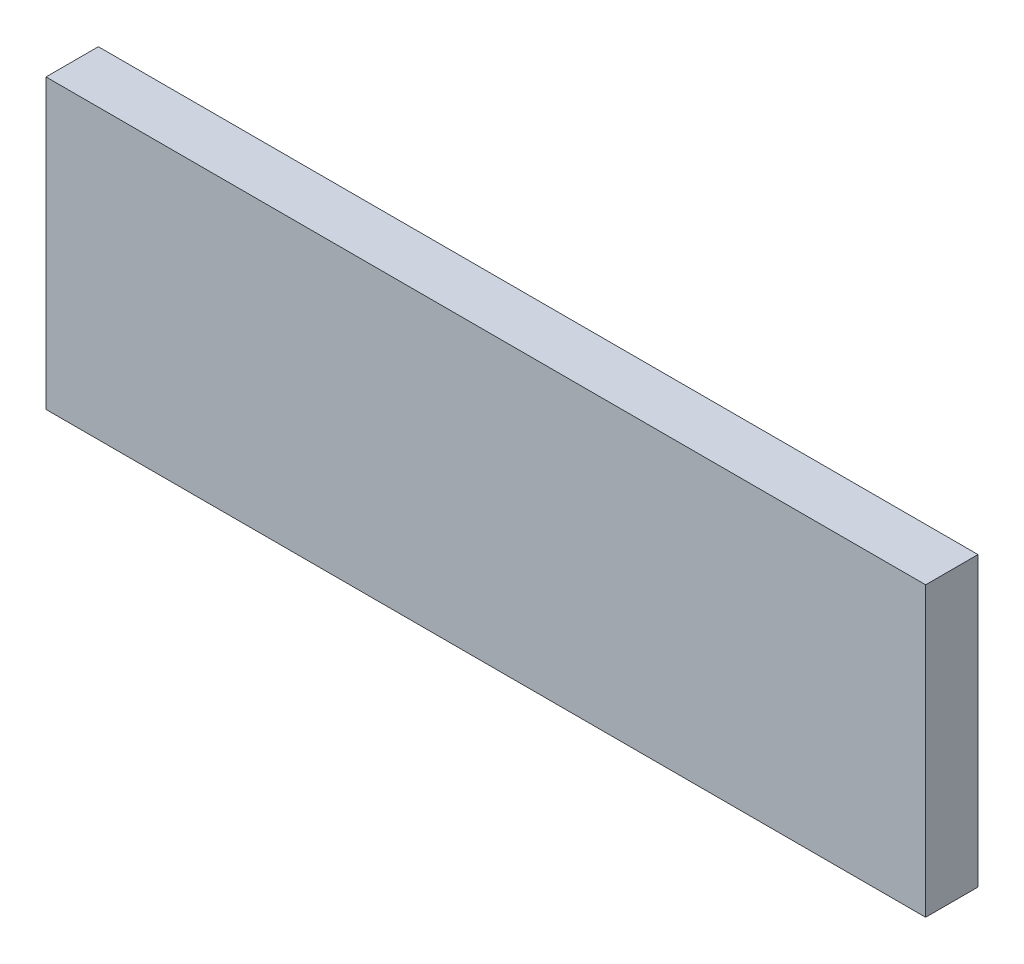
ISO-10303-21;
HEADER;
FILE_DESCRIPTION(('STEP AP214'),'2;1');
FILE_NAME('part.step','',(''),(''),'','','');
FILE_SCHEMA(('AUTOMOTIVE_DESIGN { 1 0 10303 214 1 1 1 1 }'));
ENDSEC;
DATA;
#1=APPLICATION_CONTEXT('core data for automotive mechanical design processes');
#2=APPLICATION_PROTOCOL_DEFINITION('international standard','automotive_design',2000,#1);
#3=PRODUCT_CONTEXT('',#1,'mechanical');
#4=PRODUCT('Part','Part','',(#3));
#5=PRODUCT_RELATED_PRODUCT_CATEGORY('part','',(#4));
#6=PRODUCT_DEFINITION_FORMATION('','',#4);
#7=PRODUCT_DEFINITION_CONTEXT('part definition',#1,'design');
#8=PRODUCT_DEFINITION('design','',#6,#7);
#9=PRODUCT_DEFINITION_SHAPE('','',#8);
#10=(LENGTH_UNIT() NAMED_UNIT(*) SI_UNIT(.MILLI.,.METRE.));
#11=(NAMED_UNIT(*) PLANE_ANGLE_UNIT() SI_UNIT($,.RADIAN.));
#12=(NAMED_UNIT(*) SI_UNIT($,.STERADIAN.) SOLID_ANGLE_UNIT());
#13=UNCERTAINTY_MEASURE_WITH_UNIT(LENGTH_MEASURE(1.E-05),#10,'distance_accuracy_value','');
#14=(GEOMETRIC_REPRESENTATION_CONTEXT(3) GLOBAL_UNCERTAINTY_ASSIGNED_CONTEXT((#13)) GLOBAL_UNIT_ASSIGNED_CONTEXT((#10,
#11,#12)) REPRESENTATION_CONTEXT('',''));
#15=CARTESIAN_POINT('',(0.,0.,0.));
#16=DIRECTION('',(0.,0.,1.));
#17=DIRECTION('',(1.,0.,0.));
#18=AXIS2_PLACEMENT_3D('',#15,#16,#17);
#19=CARTESIAN_POINT('',(-88.09649989415,196.736292428198,10.));
#20=DIRECTION('',(1.,0.,0.));
#21=DIRECTION('',(0.,1.,0.));
#22=AXIS2_PLACEMENT_3D('',#19,#20,#21);
#23=PLANE('',#22);
#24=DIRECTION('',(0.,-1.,0.));
#25=VECTOR('',#24,1.);
#26=CARTESIAN_POINT('',(-88.09649989415,196.736292428198,0.));
#27=LINE('',#26,#25);
#28=CARTESIAN_POINT('',(-88.09649989415,196.736292428198,0.));
#29=VERTEX_POINT('',#28);
#30=CARTESIAN_POINT('',(-88.09649989415,141.736292428198,0.));
#31=VERTEX_POINT('',#30);
#32=EDGE_CURVE('E109',#29,#31,#27,.T.);
#33=ORIENTED_EDGE('',*,*,#32,.T.);
#34=DIRECTION('',(0.,0.,-1.));
#35=VECTOR('',#34,1.);
#36=CARTESIAN_POINT('',(-88.09649989415,141.736292428198,10.));
#37=LINE('',#36,#35);
#38=CARTESIAN_POINT('',(-88.09649989415,141.736292428198,10.));
#39=VERTEX_POINT('',#38);
#40=EDGE_CURVE('E11',#39,#31,#37,.T.);
#41=ORIENTED_EDGE('',*,*,#40,.F.);
#42=DIRECTION('',(0.,-1.,0.));
#43=VECTOR('',#42,1.);
#44=CARTESIAN_POINT('',(-88.09649989415,196.736292428198,10.));
#45=LINE('',#44,#43);
#46=CARTESIAN_POINT('',(-88.09649989415,196.736292428198,10.));
#47=VERTEX_POINT('',#46);
#48=EDGE_CURVE('E92',#47,#39,#45,.T.);
#49=ORIENTED_EDGE('',*,*,#48,.F.);
#50=DIRECTION('',(0.,0.,-1.));
#51=VECTOR('',#50,1.);
#52=CARTESIAN_POINT('',(-88.09649989415,196.736292428198,10.));
#53=LINE('',#52,#51);
#54=EDGE_CURVE('E105',#47,#29,#53,.T.);
#55=ORIENTED_EDGE('',*,*,#54,.T.);
#56=EDGE_LOOP('',(#33,#41,#49,#55));
#57=FACE_BOUND('',#56,.T.);
#58=ADVANCED_FACE('F39',(#57),#23,.F.);
#59=CARTESIAN_POINT('',(-88.09649989415,141.736292428198,10.));
#60=DIRECTION('',(0.,1.,0.));
#61=DIRECTION('',(0.,0.,1.));
#62=AXIS2_PLACEMENT_3D('',#59,#60,#61);
#63=PLANE('',#62);
#64=DIRECTION('',(1.,0.,0.));
#65=VECTOR('',#64,1.);
#66=CARTESIAN_POINT('',(-88.09649989415,141.736292428198,0.));
#67=LINE('',#66,#65);
#68=CARTESIAN_POINT('',(79.90350010585,141.736292428198,0.));
#69=VERTEX_POINT('',#68);
#70=EDGE_CURVE('E97',#31,#69,#67,.T.);
#71=ORIENTED_EDGE('',*,*,#70,.T.);
#72=DIRECTION('',(0.,0.,-1.));
#73=VECTOR('',#72,1.);
#74=CARTESIAN_POINT('',(79.90350010585,141.736292428198,10.));
#75=LINE('',#74,#73);
#76=CARTESIAN_POINT('',(79.90350010585,141.736292428198,10.));
#77=VERTEX_POINT('',#76);
#78=EDGE_CURVE('E47',#77,#69,#75,.T.);
#79=ORIENTED_EDGE('',*,*,#78,.F.);
#80=DIRECTION('',(1.,0.,0.));
#81=VECTOR('',#80,1.);
#82=CARTESIAN_POINT('',(-88.09649989415,141.736292428198,10.));
#83=LINE('',#82,#81);
#84=EDGE_CURVE('E86',#39,#77,#83,.T.);
#85=ORIENTED_EDGE('',*,*,#84,.F.);
#86=ORIENTED_EDGE('',*,*,#40,.T.);
#87=EDGE_LOOP('',(#71,#79,#85,#86));
#88=FACE_BOUND('',#87,.T.);
#89=ADVANCED_FACE('F96',(#88),#63,.F.);
#90=CARTESIAN_POINT('',(79.90350010585,196.736292428198,10.));
#91=DIRECTION('',(-1.,0.,0.));
#92=DIRECTION('',(0.,-1.,0.));
#93=AXIS2_PLACEMENT_3D('',#90,#91,#92);
#94=PLANE('',#93);
#95=DIRECTION('',(0.,1.,0.));
#96=VECTOR('',#95,1.);
#97=CARTESIAN_POINT('',(79.90350010585,196.736292428198,0.));
#98=LINE('',#97,#96);
#99=CARTESIAN_POINT('',(79.90350010585,196.736292428198,0.));
#100=VERTEX_POINT('',#99);
#101=EDGE_CURVE('E73',#69,#100,#98,.T.);
#102=ORIENTED_EDGE('',*,*,#101,.T.);
#103=DIRECTION('',(0.,0.,-1.));
#104=VECTOR('',#103,1.);
#105=CARTESIAN_POINT('',(79.90350010585,196.736292428198,10.));
#106=LINE('',#105,#104);
#107=CARTESIAN_POINT('',(79.90350010585,196.736292428198,10.));
#108=VERTEX_POINT('',#107);
#109=EDGE_CURVE('E99',#108,#100,#106,.T.);
#110=ORIENTED_EDGE('',*,*,#109,.F.);
#111=DIRECTION('',(0.,1.,0.));
#112=VECTOR('',#111,1.);
#113=CARTESIAN_POINT('',(79.90350010585,196.736292428198,10.));
#114=LINE('',#113,#112);
#115=EDGE_CURVE('E90',#77,#108,#114,.T.);
#116=ORIENTED_EDGE('',*,*,#115,.F.);
#117=ORIENTED_EDGE('',*,*,#78,.T.);
#118=EDGE_LOOP('',(#102,#110,#116,#117));
#119=FACE_BOUND('',#118,.T.);
#120=ADVANCED_FACE('F100',(#119),#94,.F.);
#121=CARTESIAN_POINT('',(-88.09649989415,196.736292428198,10.));
#122=DIRECTION('',(0.,-1.,0.));
#123=DIRECTION('',(0.,0.,-1.));
#124=AXIS2_PLACEMENT_3D('',#121,#122,#123);
#125=PLANE('',#124);
#126=DIRECTION('',(-1.,0.,0.));
#127=VECTOR('',#126,1.);
#128=CARTESIAN_POINT('',(-88.09649989415,196.736292428198,0.));
#129=LINE('',#128,#127);
#130=EDGE_CURVE('E79',#100,#29,#129,.T.);
#131=ORIENTED_EDGE('',*,*,#130,.T.);
#132=ORIENTED_EDGE('',*,*,#54,.F.);
#133=DIRECTION('',(-1.,0.,0.));
#134=VECTOR('',#133,1.);
#135=CARTESIAN_POINT('',(-88.09649989415,196.736292428198,10.));
#136=LINE('',#135,#134);
#137=EDGE_CURVE('E55',#108,#47,#136,.T.);
#138=ORIENTED_EDGE('',*,*,#137,.F.);
#139=ORIENTED_EDGE('',*,*,#109,.T.);
#140=EDGE_LOOP('',(#131,#132,#138,#139));
#141=FACE_BOUND('',#140,.T.);
#142=ADVANCED_FACE('F118',(#141),#125,.F.);
#143=CARTESIAN_POINT('',(0.,0.,10.));
#144=DIRECTION('',(0.,0.,1.));
#145=DIRECTION('',(1.,0.,0.));
#146=AXIS2_PLACEMENT_3D('',#143,#144,#145);
#147=PLANE('',#146);
#148=ORIENTED_EDGE('',*,*,#48,.T.);
#149=ORIENTED_EDGE('',*,*,#84,.T.);
#150=ORIENTED_EDGE('',*,*,#115,.T.);
#151=ORIENTED_EDGE('',*,*,#137,.T.);
#152=EDGE_LOOP('',(#148,#149,#150,#151));
#153=FACE_BOUND('',#152,.T.);
#154=ADVANCED_FACE('F88',(#153),#147,.T.);
#155=CARTESIAN_POINT('',(0.,0.,0.));
#156=DIRECTION('',(0.,0.,1.));
#157=DIRECTION('',(1.,0.,0.));
#158=AXIS2_PLACEMENT_3D('',#155,#156,#157);
#159=PLANE('',#158);
#160=ORIENTED_EDGE('',*,*,#32,.F.);
#161=ORIENTED_EDGE('',*,*,#130,.F.);
#162=ORIENTED_EDGE('',*,*,#101,.F.);
#163=ORIENTED_EDGE('',*,*,#70,.F.);
#164=EDGE_LOOP('',(#160,#161,#162,#163));
#165=FACE_BOUND('',#164,.T.);
#166=ADVANCED_FACE('F121',(#165),#159,.F.);
#167=CLOSED_SHELL('',(#58,#89,#120,#142,#154,#166));
#168=MANIFOLD_SOLID_BREP('B2',#167);
#169=ADVANCED_BREP_SHAPE_REPRESENTATION('',(#18,#168),#14);
#170=SHAPE_DEFINITION_REPRESENTATION(#9,#169);
ENDSEC;
END-ISO-10303-21;
